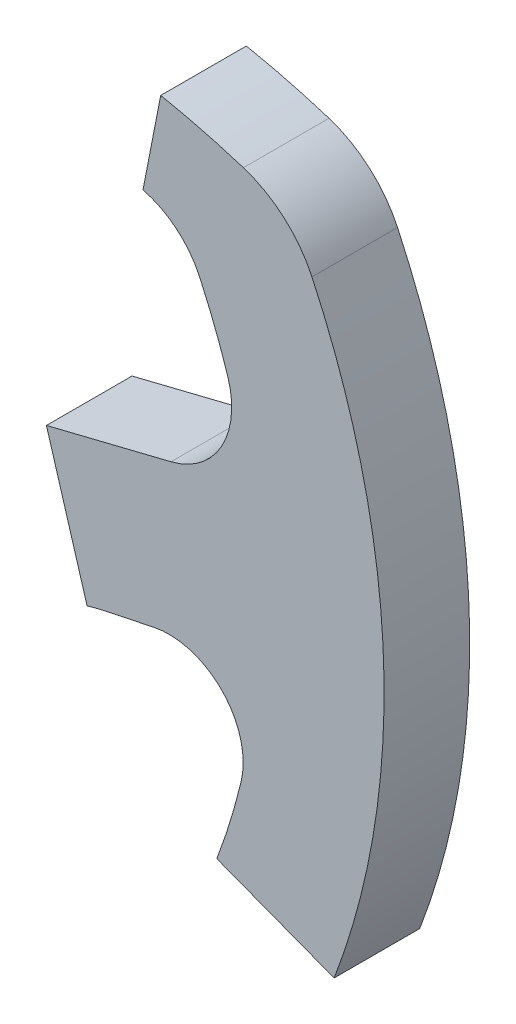
ISO-10303-21;
HEADER;
FILE_DESCRIPTION(('STEP AP214'),'2;1');
FILE_NAME('part.step','',(''),(''),'','','');
FILE_SCHEMA(('AUTOMOTIVE_DESIGN { 1 0 10303 214 1 1 1 1 }'));
ENDSEC;
DATA;
#1=APPLICATION_CONTEXT('core data for automotive mechanical design processes');
#2=APPLICATION_PROTOCOL_DEFINITION('international standard','automotive_design',2000,#1);
#3=PRODUCT_CONTEXT('',#1,'mechanical');
#4=PRODUCT('Part','Part','',(#3));
#5=PRODUCT_RELATED_PRODUCT_CATEGORY('part','',(#4));
#6=PRODUCT_DEFINITION_FORMATION('','',#4);
#7=PRODUCT_DEFINITION_CONTEXT('part definition',#1,'design');
#8=PRODUCT_DEFINITION('design','',#6,#7);
#9=PRODUCT_DEFINITION_SHAPE('','',#8);
#10=(LENGTH_UNIT() NAMED_UNIT(*) SI_UNIT(.MILLI.,.METRE.));
#11=(NAMED_UNIT(*) PLANE_ANGLE_UNIT() SI_UNIT($,.RADIAN.));
#12=(NAMED_UNIT(*) SI_UNIT($,.STERADIAN.) SOLID_ANGLE_UNIT());
#13=UNCERTAINTY_MEASURE_WITH_UNIT(LENGTH_MEASURE(1.E-05),#10,'distance_accuracy_value','');
#14=(GEOMETRIC_REPRESENTATION_CONTEXT(3) GLOBAL_UNCERTAINTY_ASSIGNED_CONTEXT((#13)) GLOBAL_UNIT_ASSIGNED_CONTEXT((#10,
#11,#12)) REPRESENTATION_CONTEXT('',''));
#15=CARTESIAN_POINT('',(0.,0.,0.));
#16=DIRECTION('',(0.,0.,1.));
#17=DIRECTION('',(1.,0.,0.));
#18=AXIS2_PLACEMENT_3D('',#15,#16,#17);
#19=CARTESIAN_POINT('',(96.6557119464771,16.4152112740775,-15.));
#20=DIRECTION('',(0.240160213214124,-0.970733265108879,0.));
#21=DIRECTION('',(0.97073326510888,0.240160213214124,0.));
#22=AXIS2_PLACEMENT_3D('',#19,#20,#21);
#23=PLANE('',#22);
#24=DIRECTION('',(0.97073326510888,0.240160213214124,0.));
#25=VECTOR('',#24,1.);
#26=CARTESIAN_POINT('',(96.6557119464771,16.4152112740775,0.));
#27=LINE('',#26,#25);
#28=CARTESIAN_POINT('',(74.8260320558074,11.0145304018182,0.));
#29=VERTEX_POINT('',#28);
#30=CARTESIAN_POINT('',(96.6557119464771,16.4152112740775,0.));
#31=VERTEX_POINT('',#30);
#32=EDGE_CURVE('E165',#29,#31,#27,.T.);
#33=ORIENTED_EDGE('',*,*,#32,.T.);
#34=DIRECTION('',(0.,0.,1.));
#35=VECTOR('',#34,1.);
#36=CARTESIAN_POINT('',(96.6557119464771,16.4152112740775,-15.));
#37=LINE('',#36,#35);
#38=CARTESIAN_POINT('',(96.6557119464771,16.4152112740775,-15.));
#39=VERTEX_POINT('',#38);
#40=EDGE_CURVE('E11',#39,#31,#37,.T.);
#41=ORIENTED_EDGE('',*,*,#40,.F.);
#42=DIRECTION('',(0.97073326510888,0.240160213214124,0.));
#43=VECTOR('',#42,1.);
#44=CARTESIAN_POINT('',(96.6557119464771,16.4152112740775,-15.));
#45=LINE('',#44,#43);
#46=CARTESIAN_POINT('',(74.8260320558074,11.0145304018182,-15.));
#47=VERTEX_POINT('',#46);
#48=EDGE_CURVE('E191',#47,#39,#45,.T.);
#49=ORIENTED_EDGE('',*,*,#48,.F.);
#50=DIRECTION('',(0.,0.,1.));
#51=VECTOR('',#50,1.);
#52=CARTESIAN_POINT('',(74.8260320558074,11.0145304018182,-15.));
#53=LINE('',#52,#51);
#54=EDGE_CURVE('E161',#47,#29,#53,.T.);
#55=ORIENTED_EDGE('',*,*,#54,.T.);
#56=EDGE_LOOP('',(#33,#41,#49,#55));
#57=FACE_BOUND('',#56,.T.);
#58=ADVANCED_FACE('F33',(#57),#23,.F.);
#59=CARTESIAN_POINT('',(93.2934689614786,30.0054769856023,-15.));
#60=DIRECTION('',(0.,0.,1.));
#61=DIRECTION('',(1.,0.,0.));
#62=AXIS2_PLACEMENT_3D('',#59,#60,#61);
#63=CYLINDRICAL_SURFACE('',#62,14.0000000000007);
#64=CARTESIAN_POINT('',(93.2934689614786,30.0054769856023,0.));
#65=DIRECTION('',(0.,0.,1.));
#66=DIRECTION('',(-1.,0.,0.));
#67=AXIS2_PLACEMENT_3D('',#64,#65,#66);
#68=CIRCLE('',#67,14.0000000000007);
#69=CARTESIAN_POINT('',(106.621107384548,34.2919736978306,0.));
#70=VERTEX_POINT('',#69);
#71=EDGE_CURVE('E168',#31,#70,#68,.T.);
#72=ORIENTED_EDGE('',*,*,#71,.T.);
#73=DIRECTION('',(0.,0.,1.));
#74=VECTOR('',#73,1.);
#75=CARTESIAN_POINT('',(106.621107384548,34.2919736978306,-15.));
#76=LINE('',#75,#74);
#77=CARTESIAN_POINT('',(106.621107384548,34.2919736978306,-15.));
#78=VERTEX_POINT('',#77);
#79=EDGE_CURVE('E41',#78,#70,#76,.T.);
#80=ORIENTED_EDGE('',*,*,#79,.F.);
#81=CARTESIAN_POINT('',(93.2934689614786,30.0054769856023,-15.));
#82=DIRECTION('',(0.,0.,1.));
#83=DIRECTION('',(-1.,0.,0.));
#84=AXIS2_PLACEMENT_3D('',#81,#82,#83);
#85=CIRCLE('',#84,14.0000000000007);
#86=EDGE_CURVE('E110',#39,#78,#85,.T.);
#87=ORIENTED_EDGE('',*,*,#86,.F.);
#88=ORIENTED_EDGE('',*,*,#40,.T.);
#89=EDGE_LOOP('',(#72,#80,#87,#88));
#90=FACE_BOUND('',#89,.T.);
#91=ADVANCED_FACE('F279',(#90),#63,.F.);
#92=CARTESIAN_POINT('',(0.,0.,-15.));
#93=DIRECTION('',(0.,0.,1.));
#94=DIRECTION('',(1.,0.,0.));
#95=AXIS2_PLACEMENT_3D('',#92,#93,#94);
#96=CYLINDRICAL_SURFACE('',#95,112.);
#97=CARTESIAN_POINT('',(0.,0.,0.));
#98=DIRECTION('',(0.,0.,1.));
#99=DIRECTION('',(-1.,0.,0.));
#100=AXIS2_PLACEMENT_3D('',#97,#98,#99);
#101=CIRCLE('',#100,112.);
#102=CARTESIAN_POINT('',(101.674756413765,46.9706707233524,0.));
#103=VERTEX_POINT('',#102);
#104=EDGE_CURVE('E170',#70,#103,#101,.T.);
#105=ORIENTED_EDGE('',*,*,#104,.T.);
#106=DIRECTION('',(0.,0.,1.));
#107=VECTOR('',#106,1.);
#108=CARTESIAN_POINT('',(101.674756413765,46.9706707233524,-15.));
#109=LINE('',#108,#107);
#110=CARTESIAN_POINT('',(101.674756413765,46.9706707233524,-15.));
#111=VERTEX_POINT('',#110);
#112=EDGE_CURVE('E216',#111,#103,#109,.T.);
#113=ORIENTED_EDGE('',*,*,#112,.F.);
#114=CARTESIAN_POINT('',(0.,0.,-15.));
#115=DIRECTION('',(0.,0.,1.));
#116=DIRECTION('',(-1.,0.,0.));
#117=AXIS2_PLACEMENT_3D('',#114,#115,#116);
#118=CIRCLE('',#117,112.);
#119=EDGE_CURVE('E224',#78,#111,#118,.T.);
#120=ORIENTED_EDGE('',*,*,#119,.F.);
#121=ORIENTED_EDGE('',*,*,#79,.T.);
#122=EDGE_LOOP('',(#105,#113,#120,#121));
#123=FACE_BOUND('',#122,.T.);
#124=ADVANCED_FACE('F222',(#123),#96,.F.);
#125=CARTESIAN_POINT('',(88.0576015369206,40.6799558943313,-15.));
#126=DIRECTION('',(0.,0.,1.));
#127=DIRECTION('',(1.,0.,0.));
#128=AXIS2_PLACEMENT_3D('',#125,#126,#127);
#129=CYLINDRICAL_SURFACE('',#128,15.0000000000009);
#130=CARTESIAN_POINT('',(88.0576015369206,40.6799558943313,0.));
#131=DIRECTION('',(0.,0.,1.));
#132=DIRECTION('',(-1.,0.,0.));
#133=AXIS2_PLACEMENT_3D('',#130,#131,#132);
#134=CIRCLE('',#133,15.0000000000009);
#135=CARTESIAN_POINT('',(91.7479402304799,55.2189173540383,0.));
#136=VERTEX_POINT('',#135);
#137=EDGE_CURVE('E172',#103,#136,#134,.T.);
#138=ORIENTED_EDGE('',*,*,#137,.T.);
#139=DIRECTION('',(0.,0.,1.));
#140=VECTOR('',#139,1.);
#141=CARTESIAN_POINT('',(91.7479402304799,55.2189173540383,-15.));
#142=LINE('',#141,#140);
#143=CARTESIAN_POINT('',(91.7479402304799,55.2189173540383,-15.));
#144=VERTEX_POINT('',#143);
#145=EDGE_CURVE('E213',#144,#136,#142,.T.);
#146=ORIENTED_EDGE('',*,*,#145,.F.);
#147=CARTESIAN_POINT('',(88.0576015369206,40.6799558943313,-15.));
#148=DIRECTION('',(0.,0.,1.));
#149=DIRECTION('',(-1.,0.,0.));
#150=AXIS2_PLACEMENT_3D('',#147,#148,#149);
#151=CIRCLE('',#150,15.0000000000009);
#152=EDGE_CURVE('E242',#111,#144,#151,.T.);
#153=ORIENTED_EDGE('',*,*,#152,.F.);
#154=ORIENTED_EDGE('',*,*,#112,.T.);
#155=EDGE_LOOP('',(#138,#146,#153,#154));
#156=FACE_BOUND('',#155,.T.);
#157=ADVANCED_FACE('F233',(#156),#129,.F.);
#158=CARTESIAN_POINT('',(91.7479402304799,55.2189173540383,-15.));
#159=DIRECTION('',(0.981456648549621,-0.191684237791595,0.));
#160=DIRECTION('',(0.191684237791595,0.981456648549622,0.));
#161=AXIS2_PLACEMENT_3D('',#158,#159,#160);
#162=PLANE('',#161);
#163=DIRECTION('',(0.191684237791595,0.981456648549622,0.));
#164=VECTOR('',#163,1.);
#165=CARTESIAN_POINT('',(91.7479402304799,55.2189173540383,0.));
#166=LINE('',#165,#164);
#167=CARTESIAN_POINT('',(94.8516465374658,71.1104336583082,0.));
#168=VERTEX_POINT('',#167);
#169=EDGE_CURVE('E174',#136,#168,#166,.T.);
#170=ORIENTED_EDGE('',*,*,#169,.T.);
#171=DIRECTION('',(0.,0.,1.));
#172=VECTOR('',#171,1.);
#173=CARTESIAN_POINT('',(94.8516465374658,71.1104336583082,-15.));
#174=LINE('',#173,#172);
#175=CARTESIAN_POINT('',(94.8516465374658,71.1104336583082,-15.));
#176=VERTEX_POINT('',#175);
#177=EDGE_CURVE('E210',#176,#168,#174,.T.);
#178=ORIENTED_EDGE('',*,*,#177,.F.);
#179=DIRECTION('',(0.191684237791595,0.981456648549622,0.));
#180=VECTOR('',#179,1.);
#181=CARTESIAN_POINT('',(91.7479402304799,55.2189173540383,-15.));
#182=LINE('',#181,#180);
#183=EDGE_CURVE('E239',#144,#176,#182,.T.);
#184=ORIENTED_EDGE('',*,*,#183,.F.);
#185=ORIENTED_EDGE('',*,*,#145,.T.);
#186=EDGE_LOOP('',(#170,#178,#184,#185));
#187=FACE_BOUND('',#186,.T.);
#188=ADVANCED_FACE('F237',(#187),#162,.F.);
#189=CARTESIAN_POINT('',(70.362317689694,-54.2791909277475,-15.));
#190=DIRECTION('',(0.,0.,1.));
#191=DIRECTION('',(1.,0.,0.));
#192=AXIS2_PLACEMENT_3D('',#189,#190,#191);
#193=CYLINDRICAL_SURFACE('',#192,127.758699043338);
#194=CARTESIAN_POINT('',(70.362317689694,-54.2791909277475,0.));
#195=DIRECTION('',(0.,0.,-1.));
#196=DIRECTION('',(-1.,0.,0.));
#197=AXIS2_PLACEMENT_3D('',#194,#195,#196);
#198=CIRCLE('',#197,127.758699043338);
#199=CARTESIAN_POINT('',(109.346193531931,67.3865092739254,0.));
#200=VERTEX_POINT('',#199);
#201=EDGE_CURVE('E176',#168,#200,#198,.T.);
#202=ORIENTED_EDGE('',*,*,#201,.T.);
#203=DIRECTION('',(0.,0.,1.));
#204=VECTOR('',#203,1.);
#205=CARTESIAN_POINT('',(109.346193531931,67.3865092739254,-15.));
#206=LINE('',#205,#204);
#207=CARTESIAN_POINT('',(109.346193531931,67.3865092739254,-15.));
#208=VERTEX_POINT('',#207);
#209=EDGE_CURVE('E207',#208,#200,#206,.T.);
#210=ORIENTED_EDGE('',*,*,#209,.F.);
#211=CARTESIAN_POINT('',(70.362317689694,-54.2791909277475,-15.));
#212=DIRECTION('',(0.,0.,-1.));
#213=DIRECTION('',(-1.,0.,0.));
#214=AXIS2_PLACEMENT_3D('',#211,#212,#213);
#215=CIRCLE('',#214,127.758699043338);
#216=EDGE_CURVE('E241',#176,#208,#215,.T.);
#217=ORIENTED_EDGE('',*,*,#216,.F.);
#218=ORIENTED_EDGE('',*,*,#177,.T.);
#219=EDGE_LOOP('',(#202,#210,#217,#218));
#220=FACE_BOUND('',#219,.T.);
#221=ADVANCED_FACE('F292',(#220),#193,.T.);
#222=CARTESIAN_POINT('',(103.243458276461,48.3403384671294,-15.));
#223=DIRECTION('',(0.,0.,1.));
#224=DIRECTION('',(1.,0.,0.));
#225=AXIS2_PLACEMENT_3D('',#222,#223,#224);
#226=CYLINDRICAL_SURFACE('',#225,20.);
#227=CARTESIAN_POINT('',(103.243458276461,48.3403384671294,0.));
#228=DIRECTION('',(0.,0.,-1.));
#229=DIRECTION('',(-1.,0.,0.));
#230=AXIS2_PLACEMENT_3D('',#227,#228,#229);
#231=CIRCLE('',#230,20.);
#232=CARTESIAN_POINT('',(121.356345693384,56.8210996017135,0.));
#233=VERTEX_POINT('',#232);
#234=EDGE_CURVE('E178',#200,#233,#231,.T.);
#235=ORIENTED_EDGE('',*,*,#234,.T.);
#236=DIRECTION('',(0.,0.,1.));
#237=VECTOR('',#236,1.);
#238=CARTESIAN_POINT('',(121.356345693384,56.8210996017135,-15.));
#239=LINE('',#238,#237);
#240=CARTESIAN_POINT('',(121.356345693384,56.8210996017135,-15.));
#241=VERTEX_POINT('',#240);
#242=EDGE_CURVE('E204',#241,#233,#239,.T.);
#243=ORIENTED_EDGE('',*,*,#242,.F.);
#244=CARTESIAN_POINT('',(103.243458276461,48.3403384671294,-15.));
#245=DIRECTION('',(0.,0.,-1.));
#246=DIRECTION('',(-1.,0.,0.));
#247=AXIS2_PLACEMENT_3D('',#244,#245,#246);
#248=CIRCLE('',#247,20.);
#249=EDGE_CURVE('E244',#208,#241,#248,.T.);
#250=ORIENTED_EDGE('',*,*,#249,.F.);
#251=ORIENTED_EDGE('',*,*,#209,.T.);
#252=EDGE_LOOP('',(#235,#243,#250,#251));
#253=FACE_BOUND('',#252,.T.);
#254=ADVANCED_FACE('F295',(#253),#226,.T.);
#255=CARTESIAN_POINT('',(4.71844785465692E-13,0.,-15.));
#256=DIRECTION('',(0.,0.,1.));
#257=DIRECTION('',(1.,0.,0.));
#258=AXIS2_PLACEMENT_3D('',#255,#256,#257);
#259=CYLINDRICAL_SURFACE('',#258,134.);
#260=CARTESIAN_POINT('',(4.71844785465692E-13,0.,0.));
#261=DIRECTION('',(0.,0.,-1.));
#262=DIRECTION('',(1.,0.,0.));
#263=AXIS2_PLACEMENT_3D('',#260,#261,#262);
#264=CIRCLE('',#263,134.);
#265=CARTESIAN_POINT('',(125.246132685185,-47.6382855212586,0.));
#266=VERTEX_POINT('',#265);
#267=EDGE_CURVE('E180',#233,#266,#264,.T.);
#268=ORIENTED_EDGE('',*,*,#267,.T.);
#269=DIRECTION('',(0.,0.,1.));
#270=VECTOR('',#269,1.);
#271=CARTESIAN_POINT('',(125.246132685185,-47.6382855212586,-15.));
#272=LINE('',#271,#270);
#273=CARTESIAN_POINT('',(125.246132685185,-47.6382855212586,-15.));
#274=VERTEX_POINT('',#273);
#275=EDGE_CURVE('E201',#274,#266,#272,.T.);
#276=ORIENTED_EDGE('',*,*,#275,.F.);
#277=CARTESIAN_POINT('',(4.71844785465692E-13,0.,-15.));
#278=DIRECTION('',(0.,0.,-1.));
#279=DIRECTION('',(1.,0.,0.));
#280=AXIS2_PLACEMENT_3D('',#277,#278,#279);
#281=CIRCLE('',#280,134.);
#282=EDGE_CURVE('E250',#241,#274,#281,.T.);
#283=ORIENTED_EDGE('',*,*,#282,.F.);
#284=ORIENTED_EDGE('',*,*,#242,.T.);
#285=EDGE_LOOP('',(#268,#276,#283,#284));
#286=FACE_BOUND('',#285,.T.);
#287=ADVANCED_FACE('F299',(#286),#259,.T.);
#288=CARTESIAN_POINT('',(104.683334781647,-39.8170744655295,-15.));
#289=DIRECTION('',(0.355509593442228,0.934672631978995,0.));
#290=DIRECTION('',(-0.934672631978995,0.355509593442228,0.));
#291=AXIS2_PLACEMENT_3D('',#288,#289,#290);
#292=PLANE('',#291);
#293=DIRECTION('',(-0.934672631978995,0.355509593442228,0.));
#294=VECTOR('',#293,1.);
#295=CARTESIAN_POINT('',(104.683334781647,-39.8170744655295,0.));
#296=LINE('',#295,#294);
#297=CARTESIAN_POINT('',(104.683334781647,-39.8170744655295,0.));
#298=VERTEX_POINT('',#297);
#299=EDGE_CURVE('E182',#266,#298,#296,.T.);
#300=ORIENTED_EDGE('',*,*,#299,.T.);
#301=DIRECTION('',(0.,0.,1.));
#302=VECTOR('',#301,1.);
#303=CARTESIAN_POINT('',(104.683334781647,-39.8170744655295,-15.));
#304=LINE('',#303,#302);
#305=CARTESIAN_POINT('',(104.683334781647,-39.8170744655295,-15.));
#306=VERTEX_POINT('',#305);
#307=EDGE_CURVE('E198',#306,#298,#304,.T.);
#308=ORIENTED_EDGE('',*,*,#307,.F.);
#309=DIRECTION('',(-0.934672631978995,0.355509593442228,0.));
#310=VECTOR('',#309,1.);
#311=CARTESIAN_POINT('',(104.683334781647,-39.8170744655295,-15.));
#312=LINE('',#311,#310);
#313=EDGE_CURVE('E252',#274,#306,#312,.T.);
#314=ORIENTED_EDGE('',*,*,#313,.F.);
#315=ORIENTED_EDGE('',*,*,#275,.T.);
#316=EDGE_LOOP('',(#300,#308,#314,#315));
#317=FACE_BOUND('',#316,.T.);
#318=ADVANCED_FACE('F303',(#317),#292,.F.);
#319=CARTESIAN_POINT('',(0.,0.,-15.));
#320=DIRECTION('',(0.,0.,1.));
#321=DIRECTION('',(1.,0.,0.));
#322=AXIS2_PLACEMENT_3D('',#319,#320,#321);
#323=CYLINDRICAL_SURFACE('',#322,112.);
#324=CARTESIAN_POINT('',(0.,0.,0.));
#325=DIRECTION('',(0.,0.,1.));
#326=DIRECTION('',(-1.,0.,0.));
#327=AXIS2_PLACEMENT_3D('',#324,#325,#326);
#328=CIRCLE('',#327,112.);
#329=CARTESIAN_POINT('',(108.951787413255,-25.9520330505489,0.));
#330=VERTEX_POINT('',#329);
#331=EDGE_CURVE('E184',#298,#330,#328,.T.);
#332=ORIENTED_EDGE('',*,*,#331,.T.);
#333=DIRECTION('',(0.,0.,1.));
#334=VECTOR('',#333,1.);
#335=CARTESIAN_POINT('',(108.951787413255,-25.9520330505489,-15.));
#336=LINE('',#335,#334);
#337=CARTESIAN_POINT('',(108.951787413255,-25.9520330505489,-15.));
#338=VERTEX_POINT('',#337);
#339=EDGE_CURVE('E195',#338,#330,#336,.T.);
#340=ORIENTED_EDGE('',*,*,#339,.F.);
#341=CARTESIAN_POINT('',(0.,0.,-15.));
#342=DIRECTION('',(0.,0.,1.));
#343=DIRECTION('',(-1.,0.,0.));
#344=AXIS2_PLACEMENT_3D('',#341,#342,#343);
#345=CIRCLE('',#344,112.);
#346=EDGE_CURVE('E254',#306,#338,#345,.T.);
#347=ORIENTED_EDGE('',*,*,#346,.F.);
#348=ORIENTED_EDGE('',*,*,#307,.T.);
#349=EDGE_LOOP('',(#332,#340,#347,#348));
#350=FACE_BOUND('',#349,.T.);
#351=ADVANCED_FACE('F260',(#350),#323,.F.);
#352=CARTESIAN_POINT('',(96.3055978027882,-22.9397435000388,-15.));
#353=DIRECTION('',(0.,0.,1.));
#354=DIRECTION('',(1.,0.,0.));
#355=AXIS2_PLACEMENT_3D('',#352,#353,#354);
#356=CYLINDRICAL_SURFACE('',#355,13.);
#357=CARTESIAN_POINT('',(96.3055978027882,-22.9397435000388,0.));
#358=DIRECTION('',(0.,0.,1.));
#359=DIRECTION('',(-1.,0.,0.));
#360=AXIS2_PLACEMENT_3D('',#357,#358,#359);
#361=CIRCLE('',#360,13.);
#362=CARTESIAN_POINT('',(93.6399204361958,-10.2159797417306,0.));
#363=VERTEX_POINT('',#362);
#364=EDGE_CURVE('E186',#330,#363,#361,.T.);
#365=ORIENTED_EDGE('',*,*,#364,.T.);
#366=DIRECTION('',(0.,0.,1.));
#367=VECTOR('',#366,1.);
#368=CARTESIAN_POINT('',(93.6399204361958,-10.2159797417306,-15.));
#369=LINE('',#368,#367);
#370=CARTESIAN_POINT('',(93.6399204361958,-10.2159797417306,-15.));
#371=VERTEX_POINT('',#370);
#372=EDGE_CURVE('E156',#371,#363,#369,.T.);
#373=ORIENTED_EDGE('',*,*,#372,.F.);
#374=CARTESIAN_POINT('',(96.3055978027882,-22.9397435000388,-15.));
#375=DIRECTION('',(0.,0.,1.));
#376=DIRECTION('',(-1.,0.,0.));
#377=AXIS2_PLACEMENT_3D('',#374,#375,#376);
#378=CIRCLE('',#377,13.);
#379=EDGE_CURVE('E147',#338,#371,#378,.T.);
#380=ORIENTED_EDGE('',*,*,#379,.F.);
#381=ORIENTED_EDGE('',*,*,#339,.T.);
#382=EDGE_LOOP('',(#365,#373,#380,#381));
#383=FACE_BOUND('',#382,.T.);
#384=ADVANCED_FACE('F264',(#383),#356,.F.);
#385=CARTESIAN_POINT('',(85.4268164886669,-11.9366565570403,-15.));
#386=DIRECTION('',(-0.205052105122494,0.978751058331399,0.));
#387=DIRECTION('',(-0.978751058331399,-0.205052105122494,0.));
#388=AXIS2_PLACEMENT_3D('',#385,#386,#387);
#389=PLANE('',#388);
#390=DIRECTION('',(-0.978751058331399,-0.205052105122494,0.));
#391=VECTOR('',#390,1.);
#392=CARTESIAN_POINT('',(85.4268164886669,-11.9366565570403,0.));
#393=LINE('',#392,#391);
#394=CARTESIAN_POINT('',(85.4268164886669,-11.9366565570403,0.));
#395=VERTEX_POINT('',#394);
#396=EDGE_CURVE('E155',#363,#395,#393,.T.);
#397=ORIENTED_EDGE('',*,*,#396,.T.);
#398=DIRECTION('',(0.,0.,1.));
#399=VECTOR('',#398,1.);
#400=CARTESIAN_POINT('',(85.4268164886669,-11.9366565570403,-15.));
#401=LINE('',#400,#399);
#402=CARTESIAN_POINT('',(85.4268164886669,-11.9366565570403,-15.));
#403=VERTEX_POINT('',#402);
#404=EDGE_CURVE('E152',#403,#395,#401,.T.);
#405=ORIENTED_EDGE('',*,*,#404,.F.);
#406=DIRECTION('',(-0.978751058331399,-0.205052105122494,0.));
#407=VECTOR('',#406,1.);
#408=CARTESIAN_POINT('',(85.4268164886669,-11.9366565570403,-15.));
#409=LINE('',#408,#407);
#410=EDGE_CURVE('E141',#371,#403,#409,.T.);
#411=ORIENTED_EDGE('',*,*,#410,.F.);
#412=ORIENTED_EDGE('',*,*,#372,.T.);
#413=EDGE_LOOP('',(#397,#405,#411,#412));
#414=FACE_BOUND('',#413,.T.);
#415=ADVANCED_FACE('F153',(#414),#389,.F.);
#416=CARTESIAN_POINT('',(94.1825813770452,-53.7295176733974,-15.));
#417=DIRECTION('',(0.,0.,1.));
#418=DIRECTION('',(1.,0.,0.));
#419=AXIS2_PLACEMENT_3D('',#416,#417,#418);
#420=CYLINDRICAL_SURFACE('',#419,42.7001950706513);
#421=CARTESIAN_POINT('',(94.1825813770452,-53.7295176733974,0.));
#422=DIRECTION('',(0.,0.,1.));
#423=DIRECTION('',(-1.,0.,0.));
#424=AXIS2_PLACEMENT_3D('',#421,#422,#423);
#425=CIRCLE('',#424,42.7001950706513);
#426=CARTESIAN_POINT('',(81.9514227248038,-12.8185727185889,0.));
#427=VERTEX_POINT('',#426);
#428=EDGE_CURVE('E96',#395,#427,#425,.T.);
#429=ORIENTED_EDGE('',*,*,#428,.T.);
#430=DIRECTION('',(0.,0.,1.));
#431=VECTOR('',#430,1.);
#432=CARTESIAN_POINT('',(81.9514227248038,-12.8185727185889,-15.));
#433=LINE('',#432,#431);
#434=CARTESIAN_POINT('',(81.9514227248038,-12.8185727185889,-15.));
#435=VERTEX_POINT('',#434);
#436=EDGE_CURVE('E157',#435,#427,#433,.T.);
#437=ORIENTED_EDGE('',*,*,#436,.F.);
#438=CARTESIAN_POINT('',(94.1825813770452,-53.7295176733974,-15.));
#439=DIRECTION('',(0.,0.,1.));
#440=DIRECTION('',(-1.,0.,0.));
#441=AXIS2_PLACEMENT_3D('',#438,#439,#440);
#442=CIRCLE('',#441,42.7001950706513);
#443=EDGE_CURVE('E145',#403,#435,#442,.T.);
#444=ORIENTED_EDGE('',*,*,#443,.F.);
#445=ORIENTED_EDGE('',*,*,#404,.T.);
#446=EDGE_LOOP('',(#429,#437,#444,#445));
#447=FACE_BOUND('',#446,.T.);
#448=ADVANCED_FACE('F159',(#447),#420,.F.);
#449=CARTESIAN_POINT('',(74.8260320558074,11.0145304018182,-15.));
#450=DIRECTION('',(0.958097378410543,0.286442687954929,0.));
#451=DIRECTION('',(-0.286442687954929,0.958097378410543,0.));
#452=AXIS2_PLACEMENT_3D('',#449,#450,#451);
#453=PLANE('',#452);
#454=DIRECTION('',(-0.286442687954929,0.958097378410543,0.));
#455=VECTOR('',#454,1.);
#456=CARTESIAN_POINT('',(74.8260320558074,11.0145304018182,0.));
#457=LINE('',#456,#455);
#458=EDGE_CURVE('E102',#427,#29,#457,.T.);
#459=ORIENTED_EDGE('',*,*,#458,.T.);
#460=ORIENTED_EDGE('',*,*,#54,.F.);
#461=DIRECTION('',(-0.286442687954929,0.958097378410543,0.));
#462=VECTOR('',#461,1.);
#463=CARTESIAN_POINT('',(74.8260320558074,11.0145304018182,-15.));
#464=LINE('',#463,#462);
#465=EDGE_CURVE('E49',#435,#47,#464,.T.);
#466=ORIENTED_EDGE('',*,*,#465,.F.);
#467=ORIENTED_EDGE('',*,*,#436,.T.);
#468=EDGE_LOOP('',(#459,#460,#466,#467));
#469=FACE_BOUND('',#468,.T.);
#470=ADVANCED_FACE('F268',(#469),#453,.F.);
#471=CARTESIAN_POINT('',(94.1825813770452,-53.7295176733974,-15.));
#472=DIRECTION('',(0.,0.,-1.));
#473=DIRECTION('',(-1.,0.,0.));
#474=AXIS2_PLACEMENT_3D('',#471,#472,#473);
#475=PLANE('',#474);
#476=ORIENTED_EDGE('',*,*,#48,.T.);
#477=ORIENTED_EDGE('',*,*,#86,.T.);
#478=ORIENTED_EDGE('',*,*,#119,.T.);
#479=ORIENTED_EDGE('',*,*,#152,.T.);
#480=ORIENTED_EDGE('',*,*,#183,.T.);
#481=ORIENTED_EDGE('',*,*,#216,.T.);
#482=ORIENTED_EDGE('',*,*,#249,.T.);
#483=ORIENTED_EDGE('',*,*,#282,.T.);
#484=ORIENTED_EDGE('',*,*,#313,.T.);
#485=ORIENTED_EDGE('',*,*,#346,.T.);
#486=ORIENTED_EDGE('',*,*,#379,.T.);
#487=ORIENTED_EDGE('',*,*,#410,.T.);
#488=ORIENTED_EDGE('',*,*,#443,.T.);
#489=ORIENTED_EDGE('',*,*,#465,.T.);
#490=EDGE_LOOP('',(#476,#477,#478,#479,#480,#481,#482,#483,#484,#485,#486,#487,#488,#489));
#491=FACE_BOUND('',#490,.T.);
#492=ADVANCED_FACE('F143',(#491),#475,.T.);
#493=CARTESIAN_POINT('',(94.1825813770452,-53.7295176733974,0.));
#494=DIRECTION('',(0.,0.,-1.));
#495=DIRECTION('',(-1.,0.,0.));
#496=AXIS2_PLACEMENT_3D('',#493,#494,#495);
#497=PLANE('',#496);
#498=ORIENTED_EDGE('',*,*,#32,.F.);
#499=ORIENTED_EDGE('',*,*,#458,.F.);
#500=ORIENTED_EDGE('',*,*,#428,.F.);
#501=ORIENTED_EDGE('',*,*,#396,.F.);
#502=ORIENTED_EDGE('',*,*,#364,.F.);
#503=ORIENTED_EDGE('',*,*,#331,.F.);
#504=ORIENTED_EDGE('',*,*,#299,.F.);
#505=ORIENTED_EDGE('',*,*,#267,.F.);
#506=ORIENTED_EDGE('',*,*,#234,.F.);
#507=ORIENTED_EDGE('',*,*,#201,.F.);
#508=ORIENTED_EDGE('',*,*,#169,.F.);
#509=ORIENTED_EDGE('',*,*,#137,.F.);
#510=ORIENTED_EDGE('',*,*,#104,.F.);
#511=ORIENTED_EDGE('',*,*,#71,.F.);
#512=EDGE_LOOP('',(#498,#499,#500,#501,#502,#503,#504,#505,#506,#507,#508,#509,#510,#511));
#513=FACE_BOUND('',#512,.T.);
#514=ADVANCED_FACE('F228',(#513),#497,.F.);
#515=CLOSED_SHELL('',(#58,#91,#124,#157,#188,#221,#254,#287,#318,#351,#384,#415,#448,#470,#492,#514));
#516=MANIFOLD_SOLID_BREP('B2',#515);
#517=ADVANCED_BREP_SHAPE_REPRESENTATION('',(#18,#516),#14);
#518=SHAPE_DEFINITION_REPRESENTATION(#9,#517);
ENDSEC;
END-ISO-10303-21;
